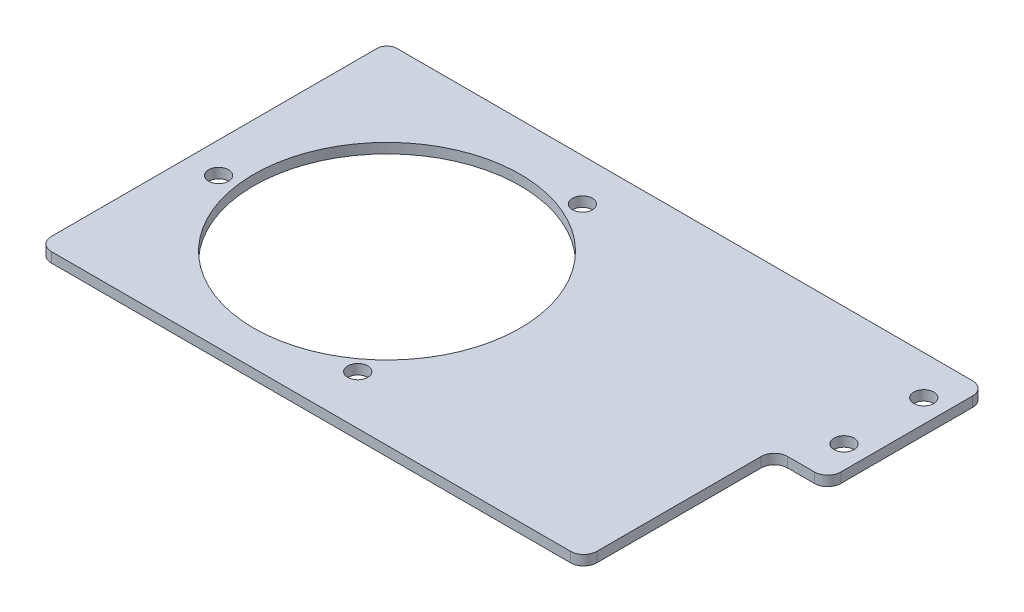
ISO-10303-21;
HEADER;
FILE_DESCRIPTION(('STEP AP214'),'2;1');
FILE_NAME('part.step','',(''),(''),'','','');
FILE_SCHEMA(('AUTOMOTIVE_DESIGN { 1 0 10303 214 1 1 1 1 }'));
ENDSEC;
DATA;
#1=APPLICATION_CONTEXT('core data for automotive mechanical design processes');
#2=APPLICATION_PROTOCOL_DEFINITION('international standard','automotive_design',2000,#1);
#3=PRODUCT_CONTEXT('',#1,'mechanical');
#4=PRODUCT('Part','Part','',(#3));
#5=PRODUCT_RELATED_PRODUCT_CATEGORY('part','',(#4));
#6=PRODUCT_DEFINITION_FORMATION('','',#4);
#7=PRODUCT_DEFINITION_CONTEXT('part definition',#1,'design');
#8=PRODUCT_DEFINITION('design','',#6,#7);
#9=PRODUCT_DEFINITION_SHAPE('','',#8);
#10=(LENGTH_UNIT() NAMED_UNIT(*) SI_UNIT(.MILLI.,.METRE.));
#11=(NAMED_UNIT(*) PLANE_ANGLE_UNIT() SI_UNIT($,.RADIAN.));
#12=(NAMED_UNIT(*) SI_UNIT($,.STERADIAN.) SOLID_ANGLE_UNIT());
#13=UNCERTAINTY_MEASURE_WITH_UNIT(LENGTH_MEASURE(1.E-05),#10,'distance_accuracy_value','');
#14=(GEOMETRIC_REPRESENTATION_CONTEXT(3) GLOBAL_UNCERTAINTY_ASSIGNED_CONTEXT((#13)) GLOBAL_UNIT_ASSIGNED_CONTEXT((#10,
#11,#12)) REPRESENTATION_CONTEXT('',''));
#15=CARTESIAN_POINT('',(0.,0.,0.));
#16=DIRECTION('',(0.,0.,1.));
#17=DIRECTION('',(1.,0.,0.));
#18=AXIS2_PLACEMENT_3D('',#15,#16,#17);
#19=CARTESIAN_POINT('',(257.59105115509,-6.35,-106.504649082993));
#20=DIRECTION('',(0.,-1.,0.));
#21=DIRECTION('',(0.,0.,-1.));
#22=AXIS2_PLACEMENT_3D('',#19,#20,#21);
#23=PLANE('',#22);
#24=CARTESIAN_POINT('',(57.0352750269157,-6.35,75.6467679704877));
#25=DIRECTION('',(0.,1.,0.));
#26=DIRECTION('',(0.,0.,1.));
#27=AXIS2_PLACEMENT_3D('',#24,#25,#26);
#28=CIRCLE('',#27,6.35000000000017);
#29=CARTESIAN_POINT('',(57.0352750269157,-6.35,81.9967679704879));
#30=VERTEX_POINT('',#29);
#31=EDGE_CURVE('E534',#30,#30,#28,.T.);
#32=ORIENTED_EDGE('',*,*,#31,.T.);
#33=EDGE_LOOP('',(#32));
#34=FACE_BOUND('',#33,.T.);
#35=CARTESIAN_POINT('',(36.1529412340076,-6.35,-88.1272780055533));
#36=DIRECTION('',(0.,1.,0.));
#37=DIRECTION('',(0.,0.,1.));
#38=AXIS2_PLACEMENT_3D('',#35,#36,#37);
#39=CIRCLE('',#38,6.35000000000035);
#40=CARTESIAN_POINT('',(36.1529412340076,-6.35,-81.777278005553));
#41=VERTEX_POINT('',#40);
#42=EDGE_CURVE('E542',#41,#41,#39,.T.);
#43=ORIENTED_EDGE('',*,*,#42,.T.);
#44=EDGE_LOOP('',(#43));
#45=FACE_BOUND('',#44,.T.);
#46=CARTESIAN_POINT('',(-95.238376165346,-6.35,11.8443765374335));
#47=DIRECTION('',(0.,1.,0.));
#48=DIRECTION('',(0.,0.,1.));
#49=AXIS2_PLACEMENT_3D('',#46,#47,#48);
#50=CIRCLE('',#49,6.34999999999583);
#51=CARTESIAN_POINT('',(-95.238376165346,-6.35,18.1943765374294));
#52=VERTEX_POINT('',#51);
#53=EDGE_CURVE('E548',#52,#52,#50,.T.);
#54=ORIENTED_EDGE('',*,*,#53,.T.);
#55=EDGE_LOOP('',(#54));
#56=FACE_BOUND('',#55,.T.);
#57=DIRECTION('',(1.,0.,0.));
#58=VECTOR('',#57,1.);
#59=CARTESIAN_POINT('',(-108.511325690417,-6.35,-114.857435108492));
#60=LINE('',#59,#58);
#61=CARTESIAN_POINT('',(-108.511325690417,-6.35,-114.857435108492));
#62=VERTEX_POINT('',#61);
#63=CARTESIAN_POINT('',(257.59105115509,-6.35,-114.857435108492));
#64=VERTEX_POINT('',#63);
#65=EDGE_CURVE('E425',#62,#64,#60,.T.);
#66=ORIENTED_EDGE('',*,*,#65,.T.);
#67=CARTESIAN_POINT('',(257.59105115509,-6.35,-106.504649082993));
#68=DIRECTION('',(0.,-1.,0.));
#69=DIRECTION('',(0.,0.,-1.));
#70=AXIS2_PLACEMENT_3D('',#67,#68,#69);
#71=CIRCLE('',#70,8.35278602549958);
#72=CARTESIAN_POINT('',(265.94383718059,-6.35,-106.504649082993));
#73=VERTEX_POINT('',#72);
#74=EDGE_CURVE('E346',#64,#73,#71,.T.);
#75=ORIENTED_EDGE('',*,*,#74,.T.);
#76=DIRECTION('',(0.,0.,1.));
#77=VECTOR('',#76,1.);
#78=CARTESIAN_POINT('',(265.94383718059,-6.35,-106.504649082993));
#79=LINE('',#78,#77);
#80=CARTESIAN_POINT('',(265.94383718059,-6.35,-22.6846490829926));
#81=VERTEX_POINT('',#80);
#82=EDGE_CURVE('E452',#73,#81,#79,.T.);
#83=ORIENTED_EDGE('',*,*,#82,.T.);
#84=CARTESIAN_POINT('',(257.59105115509,-6.35,-22.6846490829926));
#85=DIRECTION('',(0.,-1.,0.));
#86=DIRECTION('',(0.,0.,-1.));
#87=AXIS2_PLACEMENT_3D('',#84,#85,#86);
#88=CIRCLE('',#87,8.3527860254996);
#89=CARTESIAN_POINT('',(257.59105115509,-6.35,-14.331863057493));
#90=VERTEX_POINT('',#89);
#91=EDGE_CURVE('E470',#81,#90,#88,.T.);
#92=ORIENTED_EDGE('',*,*,#91,.T.);
#93=DIRECTION('',(-1.,0.,0.));
#94=VECTOR('',#93,1.);
#95=CARTESIAN_POINT('',(257.59105115509,-6.35,-14.3318630574931));
#96=LINE('',#95,#94);
#97=CARTESIAN_POINT('',(240.397032386082,-6.35,-14.3318630574931));
#98=VERTEX_POINT('',#97);
#99=EDGE_CURVE('E467',#90,#98,#96,.T.);
#100=ORIENTED_EDGE('',*,*,#99,.T.);
#101=CARTESIAN_POINT('',(240.397032386082,-6.35,-5.97907703199352));
#102=DIRECTION('',(0.,1.,0.));
#103=DIRECTION('',(0.,0.,1.));
#104=AXIS2_PLACEMENT_3D('',#101,#102,#103);
#105=CIRCLE('',#104,8.35278602549955);
#106=CARTESIAN_POINT('',(232.044246360582,-6.35,-5.97907703199352));
#107=VERTEX_POINT('',#106);
#108=EDGE_CURVE('E469',#98,#107,#105,.T.);
#109=ORIENTED_EDGE('',*,*,#108,.T.);
#110=DIRECTION('',(0.,0.,1.));
#111=VECTOR('',#110,1.);
#112=CARTESIAN_POINT('',(232.044246360582,-6.35,-5.97907703199352));
#113=LINE('',#112,#111);
#114=CARTESIAN_POINT('',(232.044246360582,-6.35,98.5838953788522));
#115=VERTEX_POINT('',#114);
#116=EDGE_CURVE('E472',#107,#115,#113,.T.);
#117=ORIENTED_EDGE('',*,*,#116,.T.);
#118=CARTESIAN_POINT('',(223.691460335083,-6.35,98.5838953788522));
#119=DIRECTION('',(0.,-1.,0.));
#120=DIRECTION('',(0.,0.,-1.));
#121=AXIS2_PLACEMENT_3D('',#118,#119,#120);
#122=CIRCLE('',#121,8.35278602549955);
#123=CARTESIAN_POINT('',(223.691460335083,-6.35,106.936681404352));
#124=VERTEX_POINT('',#123);
#125=EDGE_CURVE('E478',#115,#124,#122,.T.);
#126=ORIENTED_EDGE('',*,*,#125,.T.);
#127=DIRECTION('',(-1.,0.,0.));
#128=VECTOR('',#127,1.);
#129=CARTESIAN_POINT('',(223.691460335083,-6.35,106.936681404352));
#130=LINE('',#129,#128);
#131=CARTESIAN_POINT('',(-106.508539664917,-6.35,106.936681404352));
#132=VERTEX_POINT('',#131);
#133=EDGE_CURVE('E380',#124,#132,#130,.T.);
#134=ORIENTED_EDGE('',*,*,#133,.T.);
#135=CARTESIAN_POINT('',(-106.508539664917,-6.35,98.5838953788522));
#136=DIRECTION('',(0.,-1.,0.));
#137=DIRECTION('',(0.,0.,-1.));
#138=AXIS2_PLACEMENT_3D('',#135,#136,#137);
#139=CIRCLE('',#138,8.35278602549957);
#140=CARTESIAN_POINT('',(-114.861325690417,-6.35,98.5838953788522));
#141=VERTEX_POINT('',#140);
#142=EDGE_CURVE('E373',#132,#141,#139,.T.);
#143=ORIENTED_EDGE('',*,*,#142,.T.);
#144=DIRECTION('',(0.,0.,-1.));
#145=VECTOR('',#144,1.);
#146=CARTESIAN_POINT('',(-114.861325690417,-6.35,98.5838953788522));
#147=LINE('',#146,#145);
#148=CARTESIAN_POINT('',(-114.861325690417,-6.35,-108.507435108492));
#149=VERTEX_POINT('',#148);
#150=EDGE_CURVE('E378',#141,#149,#147,.T.);
#151=ORIENTED_EDGE('',*,*,#150,.T.);
#152=CARTESIAN_POINT('',(-108.511325690417,-6.35,-108.507435108492));
#153=DIRECTION('',(0.,1.,0.));
#154=DIRECTION('',(0.,0.,1.));
#155=AXIS2_PLACEMENT_3D('',#152,#153,#154);
#156=CIRCLE('',#155,6.35000000000001);
#157=EDGE_CURVE('E395',#62,#149,#156,.T.);
#158=ORIENTED_EDGE('',*,*,#157,.F.);
#159=EDGE_LOOP('',(#66,#75,#83,#92,#100,#109,#117,#126,#134,#143,#151,#158));
#160=FACE_BOUND('',#159,.T.);
#161=CARTESIAN_POINT('',(0.,-6.35,0.));
#162=DIRECTION('',(0.,1.,0.));
#163=DIRECTION('',(0.,0.,1.));
#164=AXIS2_PLACEMENT_3D('',#161,#162,#163);
#165=CIRCLE('',#164,84.7725);
#166=CARTESIAN_POINT('',(0.,-6.35,84.7725));
#167=VERTEX_POINT('',#166);
#168=EDGE_CURVE('E403',#167,#167,#165,.T.);
#169=ORIENTED_EDGE('',*,*,#168,.T.);
#170=EDGE_LOOP('',(#169));
#171=FACE_BOUND('',#170,.T.);
#172=CARTESIAN_POINT('',(251.46,-6.35,-89.9681525469329));
#173=DIRECTION('',(0.,1.,0.));
#174=DIRECTION('',(0.,0.,1.));
#175=AXIS2_PLACEMENT_3D('',#172,#173,#174);
#176=CIRCLE('',#175,6.35);
#177=CARTESIAN_POINT('',(251.46,-6.35,-83.6181525469329));
#178=VERTEX_POINT('',#177);
#179=EDGE_CURVE('E560',#178,#178,#176,.T.);
#180=ORIENTED_EDGE('',*,*,#179,.T.);
#181=EDGE_LOOP('',(#180));
#182=FACE_BOUND('',#181,.T.);
#183=CARTESIAN_POINT('',(251.46,-6.35,-39.2211456190523));
#184=DIRECTION('',(0.,-1.,0.));
#185=DIRECTION('',(0.,0.,-1.));
#186=AXIS2_PLACEMENT_3D('',#183,#184,#185);
#187=CIRCLE('',#186,6.35);
#188=CARTESIAN_POINT('',(251.46,-6.35,-45.5711456190523));
#189=VERTEX_POINT('',#188);
#190=EDGE_CURVE('E554',#189,#189,#187,.T.);
#191=ORIENTED_EDGE('',*,*,#190,.F.);
#192=EDGE_LOOP('',(#191));
#193=FACE_BOUND('',#192,.T.);
#194=ADVANCED_FACE('F278',(#34,#45,#56,#160,#171,#182,#193),#23,.T.);
#195=CARTESIAN_POINT('',(257.59105115509,0.,-106.504649082993));
#196=DIRECTION('',(0.,-1.,0.));
#197=DIRECTION('',(0.,0.,-1.));
#198=AXIS2_PLACEMENT_3D('',#195,#196,#197);
#199=PLANE('',#198);
#200=CARTESIAN_POINT('',(57.0352750269157,0.,75.6467679704877));
#201=DIRECTION('',(0.,1.,0.));
#202=DIRECTION('',(0.,0.,1.));
#203=AXIS2_PLACEMENT_3D('',#200,#201,#202);
#204=CIRCLE('',#203,6.35000000000017);
#205=CARTESIAN_POINT('',(57.0352750269157,0.,81.9967679704879));
#206=VERTEX_POINT('',#205);
#207=EDGE_CURVE('E537',#206,#206,#204,.T.);
#208=ORIENTED_EDGE('',*,*,#207,.F.);
#209=EDGE_LOOP('',(#208));
#210=FACE_BOUND('',#209,.T.);
#211=CARTESIAN_POINT('',(36.1529412340076,0.,-88.1272780055533));
#212=DIRECTION('',(0.,1.,0.));
#213=DIRECTION('',(0.,0.,1.));
#214=AXIS2_PLACEMENT_3D('',#211,#212,#213);
#215=CIRCLE('',#214,6.35000000000035);
#216=CARTESIAN_POINT('',(36.1529412340076,0.,-81.777278005553));
#217=VERTEX_POINT('',#216);
#218=EDGE_CURVE('E539',#217,#217,#215,.T.);
#219=ORIENTED_EDGE('',*,*,#218,.F.);
#220=EDGE_LOOP('',(#219));
#221=FACE_BOUND('',#220,.T.);
#222=CARTESIAN_POINT('',(-95.238376165346,0.,11.8443765374335));
#223=DIRECTION('',(0.,1.,0.));
#224=DIRECTION('',(0.,0.,1.));
#225=AXIS2_PLACEMENT_3D('',#222,#223,#224);
#226=CIRCLE('',#225,6.34999999999583);
#227=CARTESIAN_POINT('',(-95.238376165346,0.,18.1943765374294));
#228=VERTEX_POINT('',#227);
#229=EDGE_CURVE('E545',#228,#228,#226,.T.);
#230=ORIENTED_EDGE('',*,*,#229,.F.);
#231=EDGE_LOOP('',(#230));
#232=FACE_BOUND('',#231,.T.);
#233=CARTESIAN_POINT('',(251.46,0.,-89.9681525469329));
#234=DIRECTION('',(0.,1.,0.));
#235=DIRECTION('',(0.,0.,1.));
#236=AXIS2_PLACEMENT_3D('',#233,#234,#235);
#237=CIRCLE('',#236,6.35);
#238=CARTESIAN_POINT('',(251.46,0.,-83.6181525469329));
#239=VERTEX_POINT('',#238);
#240=EDGE_CURVE('E557',#239,#239,#237,.T.);
#241=ORIENTED_EDGE('',*,*,#240,.F.);
#242=EDGE_LOOP('',(#241));
#243=FACE_BOUND('',#242,.T.);
#244=CARTESIAN_POINT('',(0.,0.,0.));
#245=DIRECTION('',(0.,1.,0.));
#246=DIRECTION('',(0.,0.,1.));
#247=AXIS2_PLACEMENT_3D('',#244,#245,#246);
#248=CIRCLE('',#247,84.7725);
#249=CARTESIAN_POINT('',(0.,0.,84.7725));
#250=VERTEX_POINT('',#249);
#251=EDGE_CURVE('E563',#250,#250,#248,.T.);
#252=ORIENTED_EDGE('',*,*,#251,.F.);
#253=EDGE_LOOP('',(#252));
#254=FACE_BOUND('',#253,.T.);
#255=DIRECTION('',(1.,0.,0.));
#256=VECTOR('',#255,1.);
#257=CARTESIAN_POINT('',(-108.511325690417,0.,-114.857435108492));
#258=LINE('',#257,#256);
#259=CARTESIAN_POINT('',(-108.511325690417,0.,-114.857435108492));
#260=VERTEX_POINT('',#259);
#261=CARTESIAN_POINT('',(257.59105115509,0.,-114.857435108492));
#262=VERTEX_POINT('',#261);
#263=EDGE_CURVE('E400',#260,#262,#258,.T.);
#264=ORIENTED_EDGE('',*,*,#263,.F.);
#265=CARTESIAN_POINT('',(-108.511325690417,0.,-108.507435108492));
#266=DIRECTION('',(0.,1.,0.));
#267=DIRECTION('',(0.,0.,1.));
#268=AXIS2_PLACEMENT_3D('',#265,#266,#267);
#269=CIRCLE('',#268,6.35000000000001);
#270=CARTESIAN_POINT('',(-114.861325690417,0.,-108.507435108492));
#271=VERTEX_POINT('',#270);
#272=EDGE_CURVE('E422',#260,#271,#269,.T.);
#273=ORIENTED_EDGE('',*,*,#272,.T.);
#274=DIRECTION('',(0.,0.,-1.));
#275=VECTOR('',#274,1.);
#276=CARTESIAN_POINT('',(-114.861325690417,0.,98.5838953788522));
#277=LINE('',#276,#275);
#278=CARTESIAN_POINT('',(-114.861325690417,0.,98.5838953788522));
#279=VERTEX_POINT('',#278);
#280=EDGE_CURVE('E420',#279,#271,#277,.T.);
#281=ORIENTED_EDGE('',*,*,#280,.F.);
#282=CARTESIAN_POINT('',(-106.508539664917,0.,98.5838953788522));
#283=DIRECTION('',(0.,-1.,0.));
#284=DIRECTION('',(0.,0.,-1.));
#285=AXIS2_PLACEMENT_3D('',#282,#283,#284);
#286=CIRCLE('',#285,8.35278602549957);
#287=CARTESIAN_POINT('',(-106.508539664917,0.,106.936681404352));
#288=VERTEX_POINT('',#287);
#289=EDGE_CURVE('E389',#288,#279,#286,.T.);
#290=ORIENTED_EDGE('',*,*,#289,.F.);
#291=DIRECTION('',(-1.,0.,0.));
#292=VECTOR('',#291,1.);
#293=CARTESIAN_POINT('',(223.691460335083,0.,106.936681404352));
#294=LINE('',#293,#292);
#295=CARTESIAN_POINT('',(223.691460335083,0.,106.936681404352));
#296=VERTEX_POINT('',#295);
#297=EDGE_CURVE('E417',#296,#288,#294,.T.);
#298=ORIENTED_EDGE('',*,*,#297,.F.);
#299=CARTESIAN_POINT('',(223.691460335083,0.,98.5838953788522));
#300=DIRECTION('',(0.,-1.,0.));
#301=DIRECTION('',(0.,0.,-1.));
#302=AXIS2_PLACEMENT_3D('',#299,#300,#301);
#303=CIRCLE('',#302,8.35278602549955);
#304=CARTESIAN_POINT('',(232.044246360582,0.,98.5838953788522));
#305=VERTEX_POINT('',#304);
#306=EDGE_CURVE('E415',#305,#296,#303,.T.);
#307=ORIENTED_EDGE('',*,*,#306,.F.);
#308=DIRECTION('',(0.,0.,1.));
#309=VECTOR('',#308,1.);
#310=CARTESIAN_POINT('',(232.044246360582,0.,-5.97907703199352));
#311=LINE('',#310,#309);
#312=CARTESIAN_POINT('',(232.044246360582,0.,-5.97907703199352));
#313=VERTEX_POINT('',#312);
#314=EDGE_CURVE('E413',#313,#305,#311,.T.);
#315=ORIENTED_EDGE('',*,*,#314,.F.);
#316=CARTESIAN_POINT('',(240.397032386082,0.,-5.97907703199352));
#317=DIRECTION('',(0.,1.,0.));
#318=DIRECTION('',(0.,0.,1.));
#319=AXIS2_PLACEMENT_3D('',#316,#317,#318);
#320=CIRCLE('',#319,8.35278602549955);
#321=CARTESIAN_POINT('',(240.397032386082,0.,-14.3318630574931));
#322=VERTEX_POINT('',#321);
#323=EDGE_CURVE('E411',#322,#313,#320,.T.);
#324=ORIENTED_EDGE('',*,*,#323,.F.);
#325=DIRECTION('',(-1.,0.,0.));
#326=VECTOR('',#325,1.);
#327=CARTESIAN_POINT('',(257.59105115509,0.,-14.3318630574931));
#328=LINE('',#327,#326);
#329=CARTESIAN_POINT('',(257.59105115509,0.,-14.331863057493));
#330=VERTEX_POINT('',#329);
#331=EDGE_CURVE('E409',#330,#322,#328,.T.);
#332=ORIENTED_EDGE('',*,*,#331,.F.);
#333=CARTESIAN_POINT('',(257.59105115509,0.,-22.6846490829926));
#334=DIRECTION('',(0.,-1.,0.));
#335=DIRECTION('',(0.,0.,-1.));
#336=AXIS2_PLACEMENT_3D('',#333,#334,#335);
#337=CIRCLE('',#336,8.3527860254996);
#338=CARTESIAN_POINT('',(265.94383718059,0.,-22.6846490829926));
#339=VERTEX_POINT('',#338);
#340=EDGE_CURVE('E407',#339,#330,#337,.T.);
#341=ORIENTED_EDGE('',*,*,#340,.F.);
#342=DIRECTION('',(0.,0.,1.));
#343=VECTOR('',#342,1.);
#344=CARTESIAN_POINT('',(265.94383718059,0.,-106.504649082993));
#345=LINE('',#344,#343);
#346=CARTESIAN_POINT('',(265.94383718059,0.,-106.504649082993));
#347=VERTEX_POINT('',#346);
#348=EDGE_CURVE('E405',#347,#339,#345,.T.);
#349=ORIENTED_EDGE('',*,*,#348,.F.);
#350=CARTESIAN_POINT('',(257.59105115509,0.,-106.504649082993));
#351=DIRECTION('',(0.,-1.,0.));
#352=DIRECTION('',(0.,0.,-1.));
#353=AXIS2_PLACEMENT_3D('',#350,#351,#352);
#354=CIRCLE('',#353,8.35278602549958);
#355=EDGE_CURVE('E402',#262,#347,#354,.T.);
#356=ORIENTED_EDGE('',*,*,#355,.F.);
#357=EDGE_LOOP('',(#264,#273,#281,#290,#298,#307,#315,#324,#332,#341,#349,#356));
#358=FACE_BOUND('',#357,.T.);
#359=CARTESIAN_POINT('',(251.46,0.,-39.2211456190523));
#360=DIRECTION('',(0.,-1.,0.));
#361=DIRECTION('',(0.,0.,-1.));
#362=AXIS2_PLACEMENT_3D('',#359,#360,#361);
#363=CIRCLE('',#362,6.35);
#364=CARTESIAN_POINT('',(251.46,0.,-45.5711456190523));
#365=VERTEX_POINT('',#364);
#366=EDGE_CURVE('E551',#365,#365,#363,.T.);
#367=ORIENTED_EDGE('',*,*,#366,.T.);
#368=EDGE_LOOP('',(#367));
#369=FACE_BOUND('',#368,.T.);
#370=ADVANCED_FACE('F455',(#210,#221,#232,#243,#254,#358,#369),#199,.F.);
#371=CARTESIAN_POINT('',(-108.511325690417,-6.35,-114.857435108492));
#372=DIRECTION('',(0.,0.,1.));
#373=DIRECTION('',(1.,0.,0.));
#374=AXIS2_PLACEMENT_3D('',#371,#372,#373);
#375=PLANE('',#374);
#376=ORIENTED_EDGE('',*,*,#263,.T.);
#377=DIRECTION('',(0.,1.,0.));
#378=VECTOR('',#377,1.);
#379=CARTESIAN_POINT('',(257.59105115509,-6.35,-114.857435108492));
#380=LINE('',#379,#378);
#381=EDGE_CURVE('E12',#64,#262,#380,.T.);
#382=ORIENTED_EDGE('',*,*,#381,.F.);
#383=ORIENTED_EDGE('',*,*,#65,.F.);
#384=DIRECTION('',(0.,1.,0.));
#385=VECTOR('',#384,1.);
#386=CARTESIAN_POINT('',(-108.511325690417,-6.35,-114.857435108492));
#387=LINE('',#386,#385);
#388=EDGE_CURVE('E295',#62,#260,#387,.T.);
#389=ORIENTED_EDGE('',*,*,#388,.T.);
#390=EDGE_LOOP('',(#376,#382,#383,#389));
#391=FACE_BOUND('',#390,.T.);
#392=ADVANCED_FACE('F280',(#391),#375,.F.);
#393=CARTESIAN_POINT('',(257.59105115509,-6.35,-106.504649082993));
#394=DIRECTION('',(0.,1.,0.));
#395=DIRECTION('',(0.,0.,1.));
#396=AXIS2_PLACEMENT_3D('',#393,#394,#395);
#397=CYLINDRICAL_SURFACE('',#396,8.35278602549958);
#398=ORIENTED_EDGE('',*,*,#355,.T.);
#399=DIRECTION('',(0.,1.,0.));
#400=VECTOR('',#399,1.);
#401=CARTESIAN_POINT('',(265.94383718059,-6.35,-106.504649082993));
#402=LINE('',#401,#400);
#403=EDGE_CURVE('E287',#73,#347,#402,.T.);
#404=ORIENTED_EDGE('',*,*,#403,.F.);
#405=ORIENTED_EDGE('',*,*,#74,.F.);
#406=ORIENTED_EDGE('',*,*,#381,.T.);
#407=EDGE_LOOP('',(#398,#404,#405,#406));
#408=FACE_BOUND('',#407,.T.);
#409=ADVANCED_FACE('F572',(#408),#397,.T.);
#410=CARTESIAN_POINT('',(265.94383718059,-6.35,-106.504649082993));
#411=DIRECTION('',(-1.,0.,0.));
#412=DIRECTION('',(0.,0.,1.));
#413=AXIS2_PLACEMENT_3D('',#410,#411,#412);
#414=PLANE('',#413);
#415=ORIENTED_EDGE('',*,*,#348,.T.);
#416=DIRECTION('',(0.,1.,0.));
#417=VECTOR('',#416,1.);
#418=CARTESIAN_POINT('',(265.94383718059,-6.35,-22.6846490829926));
#419=LINE('',#418,#417);
#420=EDGE_CURVE('E444',#81,#339,#419,.T.);
#421=ORIENTED_EDGE('',*,*,#420,.F.);
#422=ORIENTED_EDGE('',*,*,#82,.F.);
#423=ORIENTED_EDGE('',*,*,#403,.T.);
#424=EDGE_LOOP('',(#415,#421,#422,#423));
#425=FACE_BOUND('',#424,.T.);
#426=ADVANCED_FACE('F450',(#425),#414,.F.);
#427=CARTESIAN_POINT('',(257.59105115509,-6.35,-22.6846490829926));
#428=DIRECTION('',(0.,1.,0.));
#429=DIRECTION('',(0.,0.,1.));
#430=AXIS2_PLACEMENT_3D('',#427,#428,#429);
#431=CYLINDRICAL_SURFACE('',#430,8.3527860254996);
#432=ORIENTED_EDGE('',*,*,#340,.T.);
#433=DIRECTION('',(0.,1.,0.));
#434=VECTOR('',#433,1.);
#435=CARTESIAN_POINT('',(257.59105115509,-6.35,-14.331863057493));
#436=LINE('',#435,#434);
#437=EDGE_CURVE('E441',#90,#330,#436,.T.);
#438=ORIENTED_EDGE('',*,*,#437,.F.);
#439=ORIENTED_EDGE('',*,*,#91,.F.);
#440=ORIENTED_EDGE('',*,*,#420,.T.);
#441=EDGE_LOOP('',(#432,#438,#439,#440));
#442=FACE_BOUND('',#441,.T.);
#443=ADVANCED_FACE('F461',(#442),#431,.T.);
#444=CARTESIAN_POINT('',(257.59105115509,-6.35,-14.3318630574931));
#445=DIRECTION('',(0.,0.,-1.));
#446=DIRECTION('',(-1.,0.,0.));
#447=AXIS2_PLACEMENT_3D('',#444,#445,#446);
#448=PLANE('',#447);
#449=ORIENTED_EDGE('',*,*,#331,.T.);
#450=DIRECTION('',(0.,1.,0.));
#451=VECTOR('',#450,1.);
#452=CARTESIAN_POINT('',(240.397032386082,-6.35,-14.3318630574931));
#453=LINE('',#452,#451);
#454=EDGE_CURVE('E438',#98,#322,#453,.T.);
#455=ORIENTED_EDGE('',*,*,#454,.F.);
#456=ORIENTED_EDGE('',*,*,#99,.F.);
#457=ORIENTED_EDGE('',*,*,#437,.T.);
#458=EDGE_LOOP('',(#449,#455,#456,#457));
#459=FACE_BOUND('',#458,.T.);
#460=ADVANCED_FACE('F465',(#459),#448,.F.);
#461=CARTESIAN_POINT('',(240.397032386082,-6.35,-5.97907703199352));
#462=DIRECTION('',(0.,1.,0.));
#463=DIRECTION('',(0.,0.,1.));
#464=AXIS2_PLACEMENT_3D('',#461,#462,#463);
#465=CYLINDRICAL_SURFACE('',#464,8.35278602549955);
#466=ORIENTED_EDGE('',*,*,#323,.T.);
#467=DIRECTION('',(0.,1.,0.));
#468=VECTOR('',#467,1.);
#469=CARTESIAN_POINT('',(232.044246360582,-6.35,-5.97907703199352));
#470=LINE('',#469,#468);
#471=EDGE_CURVE('E435',#107,#313,#470,.T.);
#472=ORIENTED_EDGE('',*,*,#471,.F.);
#473=ORIENTED_EDGE('',*,*,#108,.F.);
#474=ORIENTED_EDGE('',*,*,#454,.T.);
#475=EDGE_LOOP('',(#466,#472,#473,#474));
#476=FACE_BOUND('',#475,.T.);
#477=ADVANCED_FACE('F584',(#476),#465,.F.);
#478=CARTESIAN_POINT('',(232.044246360582,-6.35,-5.97907703199352));
#479=DIRECTION('',(-1.,0.,0.));
#480=DIRECTION('',(0.,0.,1.));
#481=AXIS2_PLACEMENT_3D('',#478,#479,#480);
#482=PLANE('',#481);
#483=ORIENTED_EDGE('',*,*,#314,.T.);
#484=DIRECTION('',(0.,1.,0.));
#485=VECTOR('',#484,1.);
#486=CARTESIAN_POINT('',(232.044246360582,-6.35,98.5838953788522));
#487=LINE('',#486,#485);
#488=EDGE_CURVE('E432',#115,#305,#487,.T.);
#489=ORIENTED_EDGE('',*,*,#488,.F.);
#490=ORIENTED_EDGE('',*,*,#116,.F.);
#491=ORIENTED_EDGE('',*,*,#471,.T.);
#492=EDGE_LOOP('',(#483,#489,#490,#491));
#493=FACE_BOUND('',#492,.T.);
#494=ADVANCED_FACE('F587',(#493),#482,.F.);
#495=CARTESIAN_POINT('',(223.691460335083,-6.35,98.5838953788522));
#496=DIRECTION('',(0.,1.,0.));
#497=DIRECTION('',(0.,0.,1.));
#498=AXIS2_PLACEMENT_3D('',#495,#496,#497);
#499=CYLINDRICAL_SURFACE('',#498,8.35278602549955);
#500=ORIENTED_EDGE('',*,*,#306,.T.);
#501=DIRECTION('',(0.,1.,0.));
#502=VECTOR('',#501,1.);
#503=CARTESIAN_POINT('',(223.691460335083,-6.35,106.936681404352));
#504=LINE('',#503,#502);
#505=EDGE_CURVE('E429',#124,#296,#504,.T.);
#506=ORIENTED_EDGE('',*,*,#505,.F.);
#507=ORIENTED_EDGE('',*,*,#125,.F.);
#508=ORIENTED_EDGE('',*,*,#488,.T.);
#509=EDGE_LOOP('',(#500,#506,#507,#508));
#510=FACE_BOUND('',#509,.T.);
#511=ADVANCED_FACE('F484',(#510),#499,.T.);
#512=CARTESIAN_POINT('',(223.691460335083,-6.35,106.936681404352));
#513=DIRECTION('',(0.,0.,-1.));
#514=DIRECTION('',(-1.,0.,0.));
#515=AXIS2_PLACEMENT_3D('',#512,#513,#514);
#516=PLANE('',#515);
#517=ORIENTED_EDGE('',*,*,#297,.T.);
#518=DIRECTION('',(0.,1.,0.));
#519=VECTOR('',#518,1.);
#520=CARTESIAN_POINT('',(-106.508539664917,-6.35,106.936681404352));
#521=LINE('',#520,#519);
#522=EDGE_CURVE('E392',#132,#288,#521,.T.);
#523=ORIENTED_EDGE('',*,*,#522,.F.);
#524=ORIENTED_EDGE('',*,*,#133,.F.);
#525=ORIENTED_EDGE('',*,*,#505,.T.);
#526=EDGE_LOOP('',(#517,#523,#524,#525));
#527=FACE_BOUND('',#526,.T.);
#528=ADVANCED_FACE('F488',(#527),#516,.F.);
#529=CARTESIAN_POINT('',(-106.508539664917,-6.35,98.5838953788522));
#530=DIRECTION('',(0.,1.,0.));
#531=DIRECTION('',(0.,0.,1.));
#532=AXIS2_PLACEMENT_3D('',#529,#530,#531);
#533=CYLINDRICAL_SURFACE('',#532,8.35278602549957);
#534=ORIENTED_EDGE('',*,*,#289,.T.);
#535=DIRECTION('',(0.,1.,0.));
#536=VECTOR('',#535,1.);
#537=CARTESIAN_POINT('',(-114.861325690417,-6.35,98.5838953788522));
#538=LINE('',#537,#536);
#539=EDGE_CURVE('E386',#141,#279,#538,.T.);
#540=ORIENTED_EDGE('',*,*,#539,.F.);
#541=ORIENTED_EDGE('',*,*,#142,.F.);
#542=ORIENTED_EDGE('',*,*,#522,.T.);
#543=EDGE_LOOP('',(#534,#540,#541,#542));
#544=FACE_BOUND('',#543,.T.);
#545=ADVANCED_FACE('F387',(#544),#533,.T.);
#546=CARTESIAN_POINT('',(-114.861325690417,-6.35,98.5838953788522));
#547=DIRECTION('',(1.,0.,0.));
#548=DIRECTION('',(0.,0.,-1.));
#549=AXIS2_PLACEMENT_3D('',#546,#547,#548);
#550=PLANE('',#549);
#551=ORIENTED_EDGE('',*,*,#280,.T.);
#552=DIRECTION('',(0.,1.,0.));
#553=VECTOR('',#552,1.);
#554=CARTESIAN_POINT('',(-114.861325690417,-6.35,-108.507435108492));
#555=LINE('',#554,#553);
#556=EDGE_CURVE('E334',#149,#271,#555,.T.);
#557=ORIENTED_EDGE('',*,*,#556,.F.);
#558=ORIENTED_EDGE('',*,*,#150,.F.);
#559=ORIENTED_EDGE('',*,*,#539,.T.);
#560=EDGE_LOOP('',(#551,#557,#558,#559));
#561=FACE_BOUND('',#560,.T.);
#562=ADVANCED_FACE('F394',(#561),#550,.F.);
#563=CARTESIAN_POINT('',(-108.511325690417,-6.35,-108.507435108492));
#564=DIRECTION('',(0.,1.,0.));
#565=DIRECTION('',(0.,0.,1.));
#566=AXIS2_PLACEMENT_3D('',#563,#564,#565);
#567=CYLINDRICAL_SURFACE('',#566,6.35000000000001);
#568=ORIENTED_EDGE('',*,*,#272,.F.);
#569=ORIENTED_EDGE('',*,*,#388,.F.);
#570=ORIENTED_EDGE('',*,*,#157,.T.);
#571=ORIENTED_EDGE('',*,*,#556,.T.);
#572=EDGE_LOOP('',(#568,#569,#570,#571));
#573=FACE_BOUND('',#572,.T.);
#574=ADVANCED_FACE('F489',(#573),#567,.T.);
#575=CARTESIAN_POINT('',(0.,-6.35,0.));
#576=DIRECTION('',(0.,1.,0.));
#577=DIRECTION('',(0.,0.,1.));
#578=AXIS2_PLACEMENT_3D('',#575,#576,#577);
#579=CYLINDRICAL_SURFACE('',#578,84.7725);
#580=ORIENTED_EDGE('',*,*,#168,.F.);
#581=EDGE_LOOP('',(#580));
#582=FACE_BOUND('',#581,.T.);
#583=ORIENTED_EDGE('',*,*,#251,.T.);
#584=EDGE_LOOP('',(#583));
#585=FACE_BOUND('',#584,.T.);
#586=ADVANCED_FACE('F491',(#582,#585),#579,.F.);
#587=CARTESIAN_POINT('',(251.46,-6.35,-89.9681525469329));
#588=DIRECTION('',(0.,1.,0.));
#589=DIRECTION('',(0.,0.,1.));
#590=AXIS2_PLACEMENT_3D('',#587,#588,#589);
#591=CYLINDRICAL_SURFACE('',#590,6.35);
#592=ORIENTED_EDGE('',*,*,#179,.F.);
#593=EDGE_LOOP('',(#592));
#594=FACE_BOUND('',#593,.T.);
#595=ORIENTED_EDGE('',*,*,#240,.T.);
#596=EDGE_LOOP('',(#595));
#597=FACE_BOUND('',#596,.T.);
#598=ADVANCED_FACE('F497',(#594,#597),#591,.F.);
#599=CARTESIAN_POINT('',(251.46,-6.35,-39.2211456190523));
#600=DIRECTION('',(0.,1.,0.));
#601=DIRECTION('',(0.,0.,1.));
#602=AXIS2_PLACEMENT_3D('',#599,#600,#601);
#603=CYLINDRICAL_SURFACE('',#602,6.35);
#604=ORIENTED_EDGE('',*,*,#190,.T.);
#605=EDGE_LOOP('',(#604));
#606=FACE_BOUND('',#605,.T.);
#607=ORIENTED_EDGE('',*,*,#366,.F.);
#608=EDGE_LOOP('',(#607));
#609=FACE_BOUND('',#608,.T.);
#610=ADVANCED_FACE('F514',(#606,#609),#603,.F.);
#611=CARTESIAN_POINT('',(-95.238376165346,-6.35,11.8443765374335));
#612=DIRECTION('',(0.,1.,0.));
#613=DIRECTION('',(0.,0.,1.));
#614=AXIS2_PLACEMENT_3D('',#611,#612,#613);
#615=CYLINDRICAL_SURFACE('',#614,6.34999999999583);
#616=ORIENTED_EDGE('',*,*,#53,.F.);
#617=EDGE_LOOP('',(#616));
#618=FACE_BOUND('',#617,.T.);
#619=ORIENTED_EDGE('',*,*,#229,.T.);
#620=EDGE_LOOP('',(#619));
#621=FACE_BOUND('',#620,.T.);
#622=ADVANCED_FACE('F518',(#618,#621),#615,.F.);
#623=CARTESIAN_POINT('',(36.1529412340076,-6.35,-88.1272780055533));
#624=DIRECTION('',(0.,1.,0.));
#625=DIRECTION('',(0.,0.,1.));
#626=AXIS2_PLACEMENT_3D('',#623,#624,#625);
#627=CYLINDRICAL_SURFACE('',#626,6.35000000000035);
#628=ORIENTED_EDGE('',*,*,#42,.F.);
#629=EDGE_LOOP('',(#628));
#630=FACE_BOUND('',#629,.T.);
#631=ORIENTED_EDGE('',*,*,#218,.T.);
#632=EDGE_LOOP('',(#631));
#633=FACE_BOUND('',#632,.T.);
#634=ADVANCED_FACE('F522',(#630,#633),#627,.F.);
#635=CARTESIAN_POINT('',(57.0352750269157,-6.35,75.6467679704877));
#636=DIRECTION('',(0.,1.,0.));
#637=DIRECTION('',(0.,0.,1.));
#638=AXIS2_PLACEMENT_3D('',#635,#636,#637);
#639=CYLINDRICAL_SURFACE('',#638,6.35000000000017);
#640=ORIENTED_EDGE('',*,*,#31,.F.);
#641=EDGE_LOOP('',(#640));
#642=FACE_BOUND('',#641,.T.);
#643=ORIENTED_EDGE('',*,*,#207,.T.);
#644=EDGE_LOOP('',(#643));
#645=FACE_BOUND('',#644,.T.);
#646=ADVANCED_FACE('F526',(#642,#645),#639,.F.);
#647=CLOSED_SHELL('',(#194,#370,#392,#409,#426,#443,#460,#477,#494,#511,#528,#545,#562,#574,
#586,#598,#610,#622,#634,#646));
#648=MANIFOLD_SOLID_BREP('B2',#647);
#649=ADVANCED_BREP_SHAPE_REPRESENTATION('',(#18,#648),#14);
#650=SHAPE_DEFINITION_REPRESENTATION(#9,#649);
ENDSEC;
END-ISO-10303-21;
